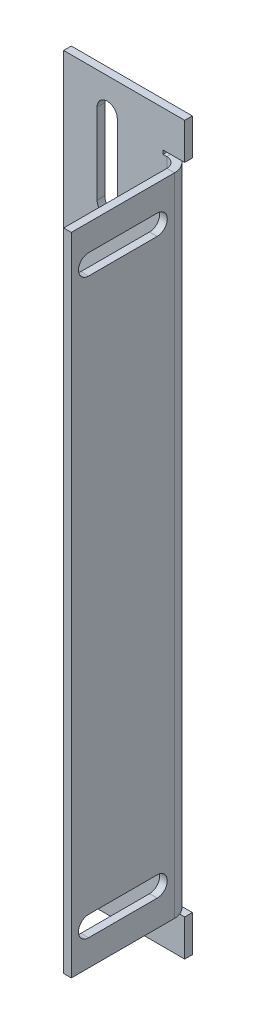
ISO-10303-21;
HEADER;
FILE_DESCRIPTION(('STEP AP214'),'2;1');
FILE_NAME('part.step','',(''),(''),'','','');
FILE_SCHEMA(('AUTOMOTIVE_DESIGN { 1 0 10303 214 1 1 1 1 }'));
ENDSEC;
DATA;
#1=APPLICATION_CONTEXT('core data for automotive mechanical design processes');
#2=APPLICATION_PROTOCOL_DEFINITION('international standard','automotive_design',2000,#1);
#3=PRODUCT_CONTEXT('',#1,'mechanical');
#4=PRODUCT('Part','Part','',(#3));
#5=PRODUCT_RELATED_PRODUCT_CATEGORY('part','',(#4));
#6=PRODUCT_DEFINITION_FORMATION('','',#4);
#7=PRODUCT_DEFINITION_CONTEXT('part definition',#1,'design');
#8=PRODUCT_DEFINITION('design','',#6,#7);
#9=PRODUCT_DEFINITION_SHAPE('','',#8);
#10=(LENGTH_UNIT() NAMED_UNIT(*) SI_UNIT(.MILLI.,.METRE.));
#11=(NAMED_UNIT(*) PLANE_ANGLE_UNIT() SI_UNIT($,.RADIAN.));
#12=(NAMED_UNIT(*) SI_UNIT($,.STERADIAN.) SOLID_ANGLE_UNIT());
#13=UNCERTAINTY_MEASURE_WITH_UNIT(LENGTH_MEASURE(1.E-05),#10,'distance_accuracy_value','');
#14=(GEOMETRIC_REPRESENTATION_CONTEXT(3) GLOBAL_UNCERTAINTY_ASSIGNED_CONTEXT((#13)) GLOBAL_UNIT_ASSIGNED_CONTEXT((#10,
#11,#12)) REPRESENTATION_CONTEXT('',''));
#15=CARTESIAN_POINT('',(0.,0.,0.));
#16=DIRECTION('',(0.,0.,1.));
#17=DIRECTION('',(1.,0.,0.));
#18=AXIS2_PLACEMENT_3D('',#15,#16,#17);
#19=CARTESIAN_POINT('',(0.,66.8554448024296,-1.89738));
#20=DIRECTION('',(1.,0.,0.));
#21=DIRECTION('',(0.,0.,-1.));
#22=AXIS2_PLACEMENT_3D('',#19,#20,#21);
#23=PLANE('',#22);
#24=DIRECTION('',(0.,1.,0.));
#25=VECTOR('',#24,1.);
#26=CARTESIAN_POINT('',(0.,66.8554448024296,0.));
#27=LINE('',#26,#25);
#28=CARTESIAN_POINT('',(0.,57.8041348024296,0.));
#29=VERTEX_POINT('',#28);
#30=CARTESIAN_POINT('',(0.,66.8554448024296,0.));
#31=VERTEX_POINT('',#30);
#32=EDGE_CURVE('E495',#29,#31,#27,.T.);
#33=ORIENTED_EDGE('',*,*,#32,.F.);
#34=DIRECTION('',(0.,0.,-1.));
#35=VECTOR('',#34,1.);
#36=CARTESIAN_POINT('',(0.,57.8041348024296,0.));
#37=LINE('',#36,#35);
#38=CARTESIAN_POINT('',(0.,57.8041348024296,-1.89738));
#39=VERTEX_POINT('',#38);
#40=EDGE_CURVE('E435',#29,#39,#37,.T.);
#41=ORIENTED_EDGE('',*,*,#40,.T.);
#42=DIRECTION('',(0.,1.,0.));
#43=VECTOR('',#42,1.);
#44=CARTESIAN_POINT('',(0.,66.8554448024296,-1.89738));
#45=LINE('',#44,#43);
#46=CARTESIAN_POINT('',(0.,66.8554448024296,-1.89738));
#47=VERTEX_POINT('',#46);
#48=EDGE_CURVE('E482',#39,#47,#45,.T.);
#49=ORIENTED_EDGE('',*,*,#48,.T.);
#50=DIRECTION('',(0.,0.,1.));
#51=VECTOR('',#50,1.);
#52=CARTESIAN_POINT('',(0.,66.8554448024296,-1.89738));
#53=LINE('',#52,#51);
#54=EDGE_CURVE('E504',#47,#31,#53,.T.);
#55=ORIENTED_EDGE('',*,*,#54,.T.);
#56=EDGE_LOOP('',(#33,#41,#49,#55));
#57=FACE_BOUND('',#56,.T.);
#58=ADVANCED_FACE('F56',(#57),#23,.T.);
#59=CARTESIAN_POINT('',(0.,-113.14455519757,-1.89738));
#60=VERTEX_POINT('',#59);
#61=CARTESIAN_POINT('',(0.,-104.09324519757,-1.89738));
#62=VERTEX_POINT('',#61);
#63=EDGE_CURVE('E483',#60,#62,#45,.T.);
#64=ORIENTED_EDGE('',*,*,#63,.T.);
#65=DIRECTION('',(0.,0.,-1.));
#66=VECTOR('',#65,1.);
#67=CARTESIAN_POINT('',(0.,-104.09324519757,0.));
#68=LINE('',#67,#66);
#69=CARTESIAN_POINT('',(0.,-104.09324519757,0.));
#70=VERTEX_POINT('',#69);
#71=EDGE_CURVE('E451',#70,#62,#68,.T.);
#72=ORIENTED_EDGE('',*,*,#71,.F.);
#73=CARTESIAN_POINT('',(0.,-113.14455519757,0.));
#74=VERTEX_POINT('',#73);
#75=EDGE_CURVE('E496',#74,#70,#27,.T.);
#76=ORIENTED_EDGE('',*,*,#75,.F.);
#77=DIRECTION('',(0.,0.,1.));
#78=VECTOR('',#77,1.);
#79=CARTESIAN_POINT('',(0.,-113.14455519757,-1.89738));
#80=LINE('',#79,#78);
#81=EDGE_CURVE('E507',#60,#74,#80,.T.);
#82=ORIENTED_EDGE('',*,*,#81,.F.);
#83=EDGE_LOOP('',(#64,#72,#76,#82));
#84=FACE_BOUND('',#83,.T.);
#85=ADVANCED_FACE('F543',(#84),#23,.T.);
#86=CARTESIAN_POINT('',(0.,0.,-1.89738));
#87=DIRECTION('',(0.,0.,1.));
#88=DIRECTION('',(1.,0.,0.));
#89=AXIS2_PLACEMENT_3D('',#86,#87,#88);
#90=PLANE('',#89);
#91=DIRECTION('',(0.,1.,0.));
#92=VECTOR('',#91,1.);
#93=CARTESIAN_POINT('',(-21.708962543054,38.8554448024297,-1.89738));
#94=LINE('',#93,#92);
#95=CARTESIAN_POINT('',(-21.708962543054,38.8554448024297,-1.89738));
#96=VERTEX_POINT('',#95);
#97=CARTESIAN_POINT('',(-21.708962543054,58.8554448024297,-1.89738));
#98=VERTEX_POINT('',#97);
#99=EDGE_CURVE('E276',#96,#98,#94,.T.);
#100=ORIENTED_EDGE('',*,*,#99,.F.);
#101=CARTESIAN_POINT('',(-19.208962543054,38.8554448024297,-1.89738));
#102=DIRECTION('',(0.,0.,-1.));
#103=DIRECTION('',(-1.,0.,0.));
#104=AXIS2_PLACEMENT_3D('',#101,#102,#103);
#105=CIRCLE('',#104,2.5);
#106=CARTESIAN_POINT('',(-16.708962543054,38.8554448024297,-1.89738));
#107=VERTEX_POINT('',#106);
#108=EDGE_CURVE('E71',#107,#96,#105,.T.);
#109=ORIENTED_EDGE('',*,*,#108,.F.);
#110=DIRECTION('',(0.,-1.,0.));
#111=VECTOR('',#110,1.);
#112=CARTESIAN_POINT('',(-16.708962543054,38.8554448024297,-1.89738));
#113=LINE('',#112,#111);
#114=CARTESIAN_POINT('',(-16.708962543054,58.8554448024297,-1.89738));
#115=VERTEX_POINT('',#114);
#116=EDGE_CURVE('E283',#115,#107,#113,.T.);
#117=ORIENTED_EDGE('',*,*,#116,.F.);
#118=CARTESIAN_POINT('',(-19.208962543054,58.8554448024297,-1.89738));
#119=DIRECTION('',(0.,0.,-1.));
#120=DIRECTION('',(-1.,0.,0.));
#121=AXIS2_PLACEMENT_3D('',#118,#119,#120);
#122=CIRCLE('',#121,2.5);
#123=EDGE_CURVE('E267',#98,#115,#122,.T.);
#124=ORIENTED_EDGE('',*,*,#123,.F.);
#125=EDGE_LOOP('',(#100,#109,#117,#124));
#126=FACE_BOUND('',#125,.T.);
#127=DIRECTION('',(0.,1.,0.));
#128=VECTOR('',#127,1.);
#129=CARTESIAN_POINT('',(-21.708962543054,-105.14455519757,-1.89738));
#130=LINE('',#129,#128);
#131=CARTESIAN_POINT('',(-21.708962543054,-105.14455519757,-1.89738));
#132=VERTEX_POINT('',#131);
#133=CARTESIAN_POINT('',(-21.708962543054,-85.1445551975703,-1.89738));
#134=VERTEX_POINT('',#133);
#135=EDGE_CURVE('E294',#132,#134,#130,.T.);
#136=ORIENTED_EDGE('',*,*,#135,.F.);
#137=CARTESIAN_POINT('',(-19.208962543054,-105.14455519757,-1.89738));
#138=DIRECTION('',(0.,0.,-1.));
#139=DIRECTION('',(-1.,0.,0.));
#140=AXIS2_PLACEMENT_3D('',#137,#138,#139);
#141=CIRCLE('',#140,2.5);
#142=CARTESIAN_POINT('',(-16.708962543054,-105.14455519757,-1.89738));
#143=VERTEX_POINT('',#142);
#144=EDGE_CURVE('E290',#143,#132,#141,.T.);
#145=ORIENTED_EDGE('',*,*,#144,.F.);
#146=DIRECTION('',(0.,-1.,0.));
#147=VECTOR('',#146,1.);
#148=CARTESIAN_POINT('',(-16.708962543054,-105.14455519757,-1.89738));
#149=LINE('',#148,#147);
#150=CARTESIAN_POINT('',(-16.708962543054,-85.1445551975703,-1.89738));
#151=VERTEX_POINT('',#150);
#152=EDGE_CURVE('E300',#151,#143,#149,.T.);
#153=ORIENTED_EDGE('',*,*,#152,.F.);
#154=CARTESIAN_POINT('',(-19.208962543054,-85.1445551975703,-1.89738));
#155=DIRECTION('',(0.,0.,-1.));
#156=DIRECTION('',(-1.,0.,0.));
#157=AXIS2_PLACEMENT_3D('',#154,#155,#156);
#158=CIRCLE('',#157,2.5);
#159=EDGE_CURVE('E297',#134,#151,#158,.T.);
#160=ORIENTED_EDGE('',*,*,#159,.F.);
#161=EDGE_LOOP('',(#136,#145,#153,#160));
#162=FACE_BOUND('',#161,.T.);
#163=DIRECTION('',(1.,0.,0.));
#164=VECTOR('',#163,1.);
#165=CARTESIAN_POINT('',(0.,57.8041348024296,-1.89738));
#166=LINE('',#165,#164);
#167=CARTESIAN_POINT('',(-5.38606999999999,57.8041348024296,-1.89738));
#168=VERTEX_POINT('',#167);
#169=EDGE_CURVE('E472',#168,#39,#166,.T.);
#170=ORIENTED_EDGE('',*,*,#169,.F.);
#171=DIRECTION('',(0.,1.,0.));
#172=VECTOR('',#171,1.);
#173=CARTESIAN_POINT('',(-5.38606999999999,0.,-1.89738));
#174=LINE('',#173,#172);
#175=CARTESIAN_POINT('',(-5.38606999999999,56.8554448024296,-1.89738));
#176=VERTEX_POINT('',#175);
#177=EDGE_CURVE('E470',#176,#168,#174,.T.);
#178=ORIENTED_EDGE('',*,*,#177,.F.);
#179=DIRECTION('',(-1.,0.,0.));
#180=VECTOR('',#179,1.);
#181=CARTESIAN_POINT('',(0.,56.8554448024296,-1.89738));
#182=LINE('',#181,#180);
#183=CARTESIAN_POINT('',(-4.43737999999999,56.8554448024296,-1.89737999999999));
#184=VERTEX_POINT('',#183);
#185=EDGE_CURVE('E468',#184,#176,#182,.T.);
#186=ORIENTED_EDGE('',*,*,#185,.F.);
#187=DIRECTION('',(0.,1.,0.));
#188=VECTOR('',#187,1.);
#189=CARTESIAN_POINT('',(-4.43737999999999,56.8554448024296,-1.89737999999999));
#190=LINE('',#189,#188);
#191=CARTESIAN_POINT('',(-4.43737999999999,-103.14455519757,-1.89738));
#192=VERTEX_POINT('',#191);
#193=EDGE_CURVE('E407',#184,#192,#190,.F.);
#194=ORIENTED_EDGE('',*,*,#193,.T.);
#195=DIRECTION('',(1.,0.,0.));
#196=VECTOR('',#195,1.);
#197=CARTESIAN_POINT('',(0.,-103.14455519757,-1.89738));
#198=LINE('',#197,#196);
#199=CARTESIAN_POINT('',(-5.38606999999999,-103.14455519757,-1.89738));
#200=VERTEX_POINT('',#199);
#201=EDGE_CURVE('E466',#200,#192,#198,.T.);
#202=ORIENTED_EDGE('',*,*,#201,.F.);
#203=DIRECTION('',(0.,1.,0.));
#204=VECTOR('',#203,1.);
#205=CARTESIAN_POINT('',(-5.38606999999999,0.,-1.89738));
#206=LINE('',#205,#204);
#207=CARTESIAN_POINT('',(-5.38606999999999,-104.09324519757,-1.89738));
#208=VERTEX_POINT('',#207);
#209=EDGE_CURVE('E464',#208,#200,#206,.T.);
#210=ORIENTED_EDGE('',*,*,#209,.F.);
#211=DIRECTION('',(-1.,0.,0.));
#212=VECTOR('',#211,1.);
#213=CARTESIAN_POINT('',(-5.36414851302966E-13,-104.09324519757,-1.89738));
#214=LINE('',#213,#212);
#215=EDGE_CURVE('E434',#62,#208,#214,.T.);
#216=ORIENTED_EDGE('',*,*,#215,.F.);
#217=ORIENTED_EDGE('',*,*,#63,.F.);
#218=DIRECTION('',(1.,0.,0.));
#219=VECTOR('',#218,1.);
#220=CARTESIAN_POINT('',(-30.,-113.14455519757,-1.89738));
#221=LINE('',#220,#219);
#222=CARTESIAN_POINT('',(-30.,-113.14455519757,-1.89738));
#223=VERTEX_POINT('',#222);
#224=EDGE_CURVE('E478',#223,#60,#221,.T.);
#225=ORIENTED_EDGE('',*,*,#224,.F.);
#226=DIRECTION('',(0.,-1.,0.));
#227=VECTOR('',#226,1.);
#228=CARTESIAN_POINT('',(-30.,66.8554448024296,-1.89738));
#229=LINE('',#228,#227);
#230=CARTESIAN_POINT('',(-30.,66.8554448024296,-1.89738));
#231=VERTEX_POINT('',#230);
#232=EDGE_CURVE('E475',#231,#223,#229,.T.);
#233=ORIENTED_EDGE('',*,*,#232,.F.);
#234=DIRECTION('',(-1.,0.,0.));
#235=VECTOR('',#234,1.);
#236=CARTESIAN_POINT('',(-30.,66.8554448024296,-1.89738));
#237=LINE('',#236,#235);
#238=EDGE_CURVE('E486',#47,#231,#237,.T.);
#239=ORIENTED_EDGE('',*,*,#238,.F.);
#240=ORIENTED_EDGE('',*,*,#48,.F.);
#241=EDGE_LOOP('',(#170,#178,#186,#194,#202,#210,#216,#217,#225,#233,#239,#240));
#242=FACE_BOUND('',#241,.T.);
#243=ADVANCED_FACE('F280',(#126,#162,#242),#90,.F.);
#244=CARTESIAN_POINT('',(0.,0.,0.));
#245=DIRECTION('',(0.,0.,1.));
#246=DIRECTION('',(1.,0.,0.));
#247=AXIS2_PLACEMENT_3D('',#244,#245,#246);
#248=PLANE('',#247);
#249=CARTESIAN_POINT('',(-19.208962543054,38.8554448024297,0.));
#250=DIRECTION('',(0.,0.,1.));
#251=DIRECTION('',(1.,0.,0.));
#252=AXIS2_PLACEMENT_3D('',#249,#250,#251);
#253=CIRCLE('',#252,2.5);
#254=CARTESIAN_POINT('',(-21.708962543054,38.8554448024297,0.));
#255=VERTEX_POINT('',#254);
#256=CARTESIAN_POINT('',(-16.708962543054,38.8554448024297,0.));
#257=VERTEX_POINT('',#256);
#258=EDGE_CURVE('E13',#255,#257,#253,.T.);
#259=ORIENTED_EDGE('',*,*,#258,.F.);
#260=DIRECTION('',(0.,-1.,0.));
#261=VECTOR('',#260,1.);
#262=CARTESIAN_POINT('',(-21.708962543054,0.,0.));
#263=LINE('',#262,#261);
#264=CARTESIAN_POINT('',(-21.708962543054,58.8554448024297,0.));
#265=VERTEX_POINT('',#264);
#266=EDGE_CURVE('E518',#265,#255,#263,.T.);
#267=ORIENTED_EDGE('',*,*,#266,.F.);
#268=CARTESIAN_POINT('',(-19.208962543054,58.8554448024297,0.));
#269=DIRECTION('',(0.,0.,1.));
#270=DIRECTION('',(1.,0.,0.));
#271=AXIS2_PLACEMENT_3D('',#268,#269,#270);
#272=CIRCLE('',#271,2.5);
#273=CARTESIAN_POINT('',(-16.708962543054,58.8554448024297,0.));
#274=VERTEX_POINT('',#273);
#275=EDGE_CURVE('E270',#274,#265,#272,.T.);
#276=ORIENTED_EDGE('',*,*,#275,.F.);
#277=DIRECTION('',(0.,1.,0.));
#278=VECTOR('',#277,1.);
#279=CARTESIAN_POINT('',(-16.708962543054,0.,0.));
#280=LINE('',#279,#278);
#281=EDGE_CURVE('E64',#257,#274,#280,.T.);
#282=ORIENTED_EDGE('',*,*,#281,.F.);
#283=EDGE_LOOP('',(#259,#267,#276,#282));
#284=FACE_BOUND('',#283,.T.);
#285=CARTESIAN_POINT('',(-19.208962543054,-105.14455519757,0.));
#286=DIRECTION('',(0.,0.,1.));
#287=DIRECTION('',(1.,0.,0.));
#288=AXIS2_PLACEMENT_3D('',#285,#286,#287);
#289=CIRCLE('',#288,2.5);
#290=CARTESIAN_POINT('',(-21.708962543054,-105.14455519757,0.));
#291=VERTEX_POINT('',#290);
#292=CARTESIAN_POINT('',(-16.708962543054,-105.14455519757,0.));
#293=VERTEX_POINT('',#292);
#294=EDGE_CURVE('E516',#291,#293,#289,.T.);
#295=ORIENTED_EDGE('',*,*,#294,.F.);
#296=DIRECTION('',(0.,-1.,0.));
#297=VECTOR('',#296,1.);
#298=CARTESIAN_POINT('',(-21.708962543054,0.,0.));
#299=LINE('',#298,#297);
#300=CARTESIAN_POINT('',(-21.708962543054,-85.1445551975703,0.));
#301=VERTEX_POINT('',#300);
#302=EDGE_CURVE('E503',#301,#291,#299,.T.);
#303=ORIENTED_EDGE('',*,*,#302,.F.);
#304=CARTESIAN_POINT('',(-19.208962543054,-85.1445551975703,0.));
#305=DIRECTION('',(0.,0.,1.));
#306=DIRECTION('',(1.,0.,0.));
#307=AXIS2_PLACEMENT_3D('',#304,#305,#306);
#308=CIRCLE('',#307,2.5);
#309=CARTESIAN_POINT('',(-16.708962543054,-85.1445551975703,0.));
#310=VERTEX_POINT('',#309);
#311=EDGE_CURVE('E511',#310,#301,#308,.T.);
#312=ORIENTED_EDGE('',*,*,#311,.F.);
#313=DIRECTION('',(0.,1.,0.));
#314=VECTOR('',#313,1.);
#315=CARTESIAN_POINT('',(-16.708962543054,0.,0.));
#316=LINE('',#315,#314);
#317=EDGE_CURVE('E514',#293,#310,#316,.T.);
#318=ORIENTED_EDGE('',*,*,#317,.F.);
#319=EDGE_LOOP('',(#295,#303,#312,#318));
#320=FACE_BOUND('',#319,.T.);
#321=DIRECTION('',(0.,-1.,0.));
#322=VECTOR('',#321,1.);
#323=CARTESIAN_POINT('',(-5.38606999999999,57.8041348024296,0.));
#324=LINE('',#323,#322);
#325=CARTESIAN_POINT('',(-5.38606999999999,57.8041348024296,0.));
#326=VERTEX_POINT('',#325);
#327=CARTESIAN_POINT('',(-5.38606999999999,56.8554448024296,0.));
#328=VERTEX_POINT('',#327);
#329=EDGE_CURVE('E436',#326,#328,#324,.T.);
#330=ORIENTED_EDGE('',*,*,#329,.F.);
#331=DIRECTION('',(-1.,0.,0.));
#332=VECTOR('',#331,1.);
#333=CARTESIAN_POINT('',(0.,57.8041348024296,0.));
#334=LINE('',#333,#332);
#335=EDGE_CURVE('E431',#29,#326,#334,.T.);
#336=ORIENTED_EDGE('',*,*,#335,.F.);
#337=ORIENTED_EDGE('',*,*,#32,.T.);
#338=DIRECTION('',(-1.,0.,0.));
#339=VECTOR('',#338,1.);
#340=CARTESIAN_POINT('',(-30.,66.8554448024296,0.));
#341=LINE('',#340,#339);
#342=CARTESIAN_POINT('',(-30.,66.8554448024296,0.));
#343=VERTEX_POINT('',#342);
#344=EDGE_CURVE('E479',#31,#343,#341,.T.);
#345=ORIENTED_EDGE('',*,*,#344,.T.);
#346=DIRECTION('',(0.,-1.,0.));
#347=VECTOR('',#346,1.);
#348=CARTESIAN_POINT('',(-30.,66.8554448024296,0.));
#349=LINE('',#348,#347);
#350=CARTESIAN_POINT('',(-30.,-113.14455519757,0.));
#351=VERTEX_POINT('',#350);
#352=EDGE_CURVE('E474',#343,#351,#349,.T.);
#353=ORIENTED_EDGE('',*,*,#352,.T.);
#354=DIRECTION('',(1.,0.,0.));
#355=VECTOR('',#354,1.);
#356=CARTESIAN_POINT('',(-30.,-113.14455519757,0.));
#357=LINE('',#356,#355);
#358=EDGE_CURVE('E492',#351,#74,#357,.T.);
#359=ORIENTED_EDGE('',*,*,#358,.T.);
#360=ORIENTED_EDGE('',*,*,#75,.T.);
#361=DIRECTION('',(1.,0.,0.));
#362=VECTOR('',#361,1.);
#363=CARTESIAN_POINT('',(-5.38606999999999,-104.09324519757,0.));
#364=LINE('',#363,#362);
#365=CARTESIAN_POINT('',(-5.38606999999999,-104.09324519757,0.));
#366=VERTEX_POINT('',#365);
#367=EDGE_CURVE('E449',#366,#70,#364,.T.);
#368=ORIENTED_EDGE('',*,*,#367,.F.);
#369=DIRECTION('',(0.,-1.,0.));
#370=VECTOR('',#369,1.);
#371=CARTESIAN_POINT('',(-5.38606999999999,-103.14455519757,0.));
#372=LINE('',#371,#370);
#373=CARTESIAN_POINT('',(-5.38606999999999,-103.14455519757,0.));
#374=VERTEX_POINT('',#373);
#375=EDGE_CURVE('E446',#374,#366,#372,.T.);
#376=ORIENTED_EDGE('',*,*,#375,.F.);
#377=DIRECTION('',(-1.,0.,0.));
#378=VECTOR('',#377,1.);
#379=CARTESIAN_POINT('',(-4.43737999999999,-103.14455519757,0.));
#380=LINE('',#379,#378);
#381=CARTESIAN_POINT('',(-4.43737999999999,-103.14455519757,0.));
#382=VERTEX_POINT('',#381);
#383=EDGE_CURVE('E443',#382,#374,#380,.T.);
#384=ORIENTED_EDGE('',*,*,#383,.F.);
#385=DIRECTION('',(0.,1.,0.));
#386=VECTOR('',#385,1.);
#387=CARTESIAN_POINT('',(-4.43737999999999,56.8554448024296,0.));
#388=LINE('',#387,#386);
#389=CARTESIAN_POINT('',(-4.43737999999999,56.8554448024296,0.));
#390=VERTEX_POINT('',#389);
#391=EDGE_CURVE('E420',#390,#382,#388,.F.);
#392=ORIENTED_EDGE('',*,*,#391,.F.);
#393=DIRECTION('',(1.,0.,0.));
#394=VECTOR('',#393,1.);
#395=CARTESIAN_POINT('',(-5.38606999999999,56.8554448024296,0.));
#396=LINE('',#395,#394);
#397=EDGE_CURVE('E440',#328,#390,#396,.T.);
#398=ORIENTED_EDGE('',*,*,#397,.F.);
#399=EDGE_LOOP('',(#330,#336,#337,#345,#353,#359,#360,#368,#376,#384,#392,#398));
#400=FACE_BOUND('',#399,.T.);
#401=ADVANCED_FACE('F526',(#284,#320,#400),#248,.T.);
#402=CARTESIAN_POINT('',(-30.,66.8554448024296,-1.89738));
#403=DIRECTION('',(-1.,0.,0.));
#404=DIRECTION('',(0.,-1.,0.));
#405=AXIS2_PLACEMENT_3D('',#402,#403,#404);
#406=PLANE('',#405);
#407=ORIENTED_EDGE('',*,*,#352,.F.);
#408=DIRECTION('',(0.,0.,1.));
#409=VECTOR('',#408,1.);
#410=CARTESIAN_POINT('',(-30.,66.8554448024296,-1.89738));
#411=LINE('',#410,#409);
#412=EDGE_CURVE('E501',#231,#343,#411,.T.);
#413=ORIENTED_EDGE('',*,*,#412,.F.);
#414=ORIENTED_EDGE('',*,*,#232,.T.);
#415=DIRECTION('',(0.,0.,1.));
#416=VECTOR('',#415,1.);
#417=CARTESIAN_POINT('',(-30.,-113.14455519757,-1.89738));
#418=LINE('',#417,#416);
#419=EDGE_CURVE('E489',#223,#351,#418,.T.);
#420=ORIENTED_EDGE('',*,*,#419,.T.);
#421=EDGE_LOOP('',(#407,#413,#414,#420));
#422=FACE_BOUND('',#421,.T.);
#423=ADVANCED_FACE('F58',(#422),#406,.T.);
#424=CARTESIAN_POINT('',(-30.,66.8554448024296,-1.89738));
#425=DIRECTION('',(0.,1.,0.));
#426=DIRECTION('',(0.,0.,1.));
#427=AXIS2_PLACEMENT_3D('',#424,#425,#426);
#428=PLANE('',#427);
#429=ORIENTED_EDGE('',*,*,#344,.F.);
#430=ORIENTED_EDGE('',*,*,#54,.F.);
#431=ORIENTED_EDGE('',*,*,#238,.T.);
#432=ORIENTED_EDGE('',*,*,#412,.T.);
#433=EDGE_LOOP('',(#429,#430,#431,#432));
#434=FACE_BOUND('',#433,.T.);
#435=ADVANCED_FACE('F552',(#434),#428,.T.);
#436=CARTESIAN_POINT('',(-30.,-113.14455519757,-1.89738));
#437=DIRECTION('',(0.,-1.,0.));
#438=DIRECTION('',(1.,0.,0.));
#439=AXIS2_PLACEMENT_3D('',#436,#437,#438);
#440=PLANE('',#439);
#441=ORIENTED_EDGE('',*,*,#358,.F.);
#442=ORIENTED_EDGE('',*,*,#419,.F.);
#443=ORIENTED_EDGE('',*,*,#224,.T.);
#444=ORIENTED_EDGE('',*,*,#81,.T.);
#445=EDGE_LOOP('',(#441,#442,#443,#444));
#446=FACE_BOUND('',#445,.T.);
#447=ADVANCED_FACE('F554',(#446),#440,.T.);
#448=CARTESIAN_POINT('',(0.,57.8041348024296,0.));
#449=DIRECTION('',(0.,-1.,0.));
#450=DIRECTION('',(0.,0.,-1.));
#451=AXIS2_PLACEMENT_3D('',#448,#449,#450);
#452=PLANE('',#451);
#453=DIRECTION('',(0.,0.,-1.));
#454=VECTOR('',#453,1.);
#455=CARTESIAN_POINT('',(-5.38606999999999,57.8041348024296,0.));
#456=LINE('',#455,#454);
#457=EDGE_CURVE('E439',#326,#168,#456,.T.);
#458=ORIENTED_EDGE('',*,*,#457,.T.);
#459=ORIENTED_EDGE('',*,*,#169,.T.);
#460=ORIENTED_EDGE('',*,*,#40,.F.);
#461=ORIENTED_EDGE('',*,*,#335,.T.);
#462=EDGE_LOOP('',(#458,#459,#460,#461));
#463=FACE_BOUND('',#462,.T.);
#464=ADVANCED_FACE('F556',(#463),#452,.T.);
#465=CARTESIAN_POINT('',(-5.38606999999999,57.8041348024296,0.));
#466=DIRECTION('',(1.,0.,0.));
#467=DIRECTION('',(0.,0.,-1.));
#468=AXIS2_PLACEMENT_3D('',#465,#466,#467);
#469=PLANE('',#468);
#470=DIRECTION('',(0.,0.,-1.));
#471=VECTOR('',#470,1.);
#472=CARTESIAN_POINT('',(-5.38606999999999,56.8554448024296,0.));
#473=LINE('',#472,#471);
#474=EDGE_CURVE('E442',#328,#176,#473,.T.);
#475=ORIENTED_EDGE('',*,*,#474,.T.);
#476=ORIENTED_EDGE('',*,*,#177,.T.);
#477=ORIENTED_EDGE('',*,*,#457,.F.);
#478=ORIENTED_EDGE('',*,*,#329,.T.);
#479=EDGE_LOOP('',(#475,#476,#477,#478));
#480=FACE_BOUND('',#479,.T.);
#481=ADVANCED_FACE('F562',(#480),#469,.T.);
#482=CARTESIAN_POINT('',(-5.38606999999999,56.8554448024296,0.));
#483=DIRECTION('',(0.,1.,0.));
#484=DIRECTION('',(0.,0.,1.));
#485=AXIS2_PLACEMENT_3D('',#482,#483,#484);
#486=PLANE('',#485);
#487=DIRECTION('',(0.,0.,-1.));
#488=VECTOR('',#487,1.);
#489=CARTESIAN_POINT('',(-4.43737999999999,56.8554448024296,0.));
#490=LINE('',#489,#488);
#491=EDGE_CURVE('E414',#390,#184,#490,.T.);
#492=ORIENTED_EDGE('',*,*,#491,.T.);
#493=ORIENTED_EDGE('',*,*,#185,.T.);
#494=ORIENTED_EDGE('',*,*,#474,.F.);
#495=ORIENTED_EDGE('',*,*,#397,.T.);
#496=EDGE_LOOP('',(#492,#493,#494,#495));
#497=FACE_BOUND('',#496,.T.);
#498=ADVANCED_FACE('F586',(#497),#486,.T.);
#499=CARTESIAN_POINT('',(-4.43737999999999,-103.14455519757,0.));
#500=DIRECTION('',(0.,-1.,0.));
#501=DIRECTION('',(0.,0.,-1.));
#502=AXIS2_PLACEMENT_3D('',#499,#500,#501);
#503=PLANE('',#502);
#504=DIRECTION('',(0.,0.,-1.));
#505=VECTOR('',#504,1.);
#506=CARTESIAN_POINT('',(-5.38606999999999,-103.14455519757,0.));
#507=LINE('',#506,#505);
#508=EDGE_CURVE('E448',#374,#200,#507,.T.);
#509=ORIENTED_EDGE('',*,*,#508,.T.);
#510=ORIENTED_EDGE('',*,*,#201,.T.);
#511=DIRECTION('',(0.,0.,-1.));
#512=VECTOR('',#511,1.);
#513=CARTESIAN_POINT('',(-4.43737999999999,-103.14455519757,0.));
#514=LINE('',#513,#512);
#515=EDGE_CURVE('E425',#382,#192,#514,.T.);
#516=ORIENTED_EDGE('',*,*,#515,.F.);
#517=ORIENTED_EDGE('',*,*,#383,.T.);
#518=EDGE_LOOP('',(#509,#510,#516,#517));
#519=FACE_BOUND('',#518,.T.);
#520=ADVANCED_FACE('F660',(#519),#503,.T.);
#521=CARTESIAN_POINT('',(-5.38606999999999,-103.14455519757,0.));
#522=DIRECTION('',(1.,0.,0.));
#523=DIRECTION('',(0.,0.,-1.));
#524=AXIS2_PLACEMENT_3D('',#521,#522,#523);
#525=PLANE('',#524);
#526=DIRECTION('',(0.,0.,-1.));
#527=VECTOR('',#526,1.);
#528=CARTESIAN_POINT('',(-5.38606999999999,-104.09324519757,0.));
#529=LINE('',#528,#527);
#530=EDGE_CURVE('E428',#366,#208,#529,.T.);
#531=ORIENTED_EDGE('',*,*,#530,.T.);
#532=ORIENTED_EDGE('',*,*,#209,.T.);
#533=ORIENTED_EDGE('',*,*,#508,.F.);
#534=ORIENTED_EDGE('',*,*,#375,.T.);
#535=EDGE_LOOP('',(#531,#532,#533,#534));
#536=FACE_BOUND('',#535,.T.);
#537=ADVANCED_FACE('F656',(#536),#525,.T.);
#538=CARTESIAN_POINT('',(-5.38606999999999,-104.09324519757,0.));
#539=DIRECTION('',(0.,1.,0.));
#540=DIRECTION('',(0.,0.,1.));
#541=AXIS2_PLACEMENT_3D('',#538,#539,#540);
#542=PLANE('',#541);
#543=ORIENTED_EDGE('',*,*,#71,.T.);
#544=ORIENTED_EDGE('',*,*,#215,.T.);
#545=ORIENTED_EDGE('',*,*,#530,.F.);
#546=ORIENTED_EDGE('',*,*,#367,.T.);
#547=EDGE_LOOP('',(#543,#544,#545,#546));
#548=FACE_BOUND('',#547,.T.);
#549=ADVANCED_FACE('F650',(#548),#542,.T.);
#550=CARTESIAN_POINT('',(-4.43737999999999,-103.14455519757,2.53999999999999));
#551=DIRECTION('',(0.,-1.,0.));
#552=DIRECTION('',(0.,0.,-1.));
#553=AXIS2_PLACEMENT_3D('',#550,#551,#552);
#554=PLANE('',#553);
#555=DIRECTION('',(-1.,0.,0.));
#556=VECTOR('',#555,1.);
#557=CARTESIAN_POINT('',(0.,-103.14455519757,2.53999999999998));
#558=LINE('',#557,#556);
#559=CARTESIAN_POINT('',(-1.89737999999999,-103.14455519757,2.53999999999998));
#560=VERTEX_POINT('',#559);
#561=CARTESIAN_POINT('',(0.,-103.14455519757,2.53999999999998));
#562=VERTEX_POINT('',#561);
#563=EDGE_CURVE('E376',#560,#562,#558,.F.);
#564=ORIENTED_EDGE('',*,*,#563,.F.);
#565=CARTESIAN_POINT('',(-4.43737999999999,-103.14455519757,2.53999999999999));
#566=DIRECTION('',(0.,1.,0.));
#567=DIRECTION('',(0.,0.,1.));
#568=AXIS2_PLACEMENT_3D('',#565,#566,#567);
#569=CIRCLE('',#568,2.54);
#570=EDGE_CURVE('E417',#382,#560,#569,.F.);
#571=ORIENTED_EDGE('',*,*,#570,.F.);
#572=ORIENTED_EDGE('',*,*,#515,.T.);
#573=CARTESIAN_POINT('',(-4.43737999999999,-103.14455519757,2.53999999999999));
#574=DIRECTION('',(0.,1.,0.));
#575=DIRECTION('',(0.,0.,1.));
#576=AXIS2_PLACEMENT_3D('',#573,#574,#575);
#577=CIRCLE('',#576,4.43738);
#578=EDGE_CURVE('E410',#192,#562,#577,.F.);
#579=ORIENTED_EDGE('',*,*,#578,.T.);
#580=EDGE_LOOP('',(#564,#571,#572,#579));
#581=FACE_BOUND('',#580,.T.);
#582=ADVANCED_FACE('F596',(#581),#554,.T.);
#583=CARTESIAN_POINT('',(-4.43737999999999,56.8554448024296,2.54));
#584=DIRECTION('',(0.,-1.,0.));
#585=DIRECTION('',(0.,0.,-1.));
#586=AXIS2_PLACEMENT_3D('',#583,#584,#585);
#587=PLANE('',#586);
#588=CARTESIAN_POINT('',(-4.43737999999999,56.8554448024296,2.54));
#589=DIRECTION('',(0.,1.,0.));
#590=DIRECTION('',(0.,0.,1.));
#591=AXIS2_PLACEMENT_3D('',#588,#589,#590);
#592=CIRCLE('',#591,2.54);
#593=CARTESIAN_POINT('',(-1.89737999999999,56.8554448024296,2.54));
#594=VERTEX_POINT('',#593);
#595=EDGE_CURVE('E380',#594,#390,#592,.T.);
#596=ORIENTED_EDGE('',*,*,#595,.F.);
#597=DIRECTION('',(-1.,0.,0.));
#598=VECTOR('',#597,1.);
#599=CARTESIAN_POINT('',(-1.89737999999998,56.8554448024296,2.53999999999999));
#600=LINE('',#599,#598);
#601=CARTESIAN_POINT('',(0.,56.8554448024296,2.53999999999999));
#602=VERTEX_POINT('',#601);
#603=EDGE_CURVE('E400',#594,#602,#600,.F.);
#604=ORIENTED_EDGE('',*,*,#603,.T.);
#605=CARTESIAN_POINT('',(-4.43737999999999,56.8554448024296,2.54));
#606=DIRECTION('',(0.,1.,0.));
#607=DIRECTION('',(0.,0.,1.));
#608=AXIS2_PLACEMENT_3D('',#605,#606,#607);
#609=CIRCLE('',#608,4.43738);
#610=EDGE_CURVE('E411',#602,#184,#609,.T.);
#611=ORIENTED_EDGE('',*,*,#610,.T.);
#612=ORIENTED_EDGE('',*,*,#491,.F.);
#613=EDGE_LOOP('',(#596,#604,#611,#612));
#614=FACE_BOUND('',#613,.T.);
#615=ADVANCED_FACE('F645',(#614),#587,.F.);
#616=CARTESIAN_POINT('',(-4.43737999999999,56.8554448024296,2.54));
#617=DIRECTION('',(0.,1.,0.));
#618=DIRECTION('',(1.,0.,0.));
#619=AXIS2_PLACEMENT_3D('',#616,#617,#618);
#620=CYLINDRICAL_SURFACE('',#619,4.43738);
#621=ORIENTED_EDGE('',*,*,#193,.F.);
#622=ORIENTED_EDGE('',*,*,#610,.F.);
#623=DIRECTION('',(0.,1.,0.));
#624=VECTOR('',#623,1.);
#625=CARTESIAN_POINT('',(0.,-103.14455519757,2.53999999999998));
#626=LINE('',#625,#624);
#627=EDGE_CURVE('E398',#602,#562,#626,.F.);
#628=ORIENTED_EDGE('',*,*,#627,.T.);
#629=ORIENTED_EDGE('',*,*,#578,.F.);
#630=EDGE_LOOP('',(#621,#622,#628,#629));
#631=FACE_BOUND('',#630,.T.);
#632=ADVANCED_FACE('F599',(#631),#620,.T.);
#633=CARTESIAN_POINT('',(-4.43737999999999,56.8554448024296,2.54));
#634=DIRECTION('',(0.,1.,0.));
#635=DIRECTION('',(1.,0.,0.));
#636=AXIS2_PLACEMENT_3D('',#633,#634,#635);
#637=CYLINDRICAL_SURFACE('',#636,2.54);
#638=ORIENTED_EDGE('',*,*,#391,.T.);
#639=ORIENTED_EDGE('',*,*,#570,.T.);
#640=DIRECTION('',(0.,1.,0.));
#641=VECTOR('',#640,1.);
#642=CARTESIAN_POINT('',(-1.89737999999999,-103.14455519757,2.53999999999998));
#643=LINE('',#642,#641);
#644=EDGE_CURVE('E403',#560,#594,#643,.T.);
#645=ORIENTED_EDGE('',*,*,#644,.T.);
#646=ORIENTED_EDGE('',*,*,#595,.T.);
#647=EDGE_LOOP('',(#638,#639,#645,#646));
#648=FACE_BOUND('',#647,.T.);
#649=ADVANCED_FACE('F620',(#648),#637,.F.);
#650=CARTESIAN_POINT('',(0.,-103.14455519757,0.));
#651=DIRECTION('',(0.,1.,0.));
#652=DIRECTION('',(0.,0.,1.));
#653=AXIS2_PLACEMENT_3D('',#650,#651,#652);
#654=PLANE('',#653);
#655=ORIENTED_EDGE('',*,*,#563,.T.);
#656=DIRECTION('',(0.,0.,-1.));
#657=VECTOR('',#656,1.);
#658=CARTESIAN_POINT('',(0.,-103.14455519757,0.));
#659=LINE('',#658,#657);
#660=CARTESIAN_POINT('',(0.,-103.14455519757,28.10262));
#661=VERTEX_POINT('',#660);
#662=EDGE_CURVE('E388',#661,#562,#659,.T.);
#663=ORIENTED_EDGE('',*,*,#662,.F.);
#664=DIRECTION('',(-1.,0.,0.));
#665=VECTOR('',#664,1.);
#666=CARTESIAN_POINT('',(0.,-103.14455519757,28.10262));
#667=LINE('',#666,#665);
#668=CARTESIAN_POINT('',(-1.8973799999999,-103.14455519757,28.10262));
#669=VERTEX_POINT('',#668);
#670=EDGE_CURVE('E381',#661,#669,#667,.T.);
#671=ORIENTED_EDGE('',*,*,#670,.T.);
#672=DIRECTION('',(0.,0.,1.));
#673=VECTOR('',#672,1.);
#674=CARTESIAN_POINT('',(-1.89738,-103.14455519757,0.));
#675=LINE('',#674,#673);
#676=EDGE_CURVE('E395',#669,#560,#675,.F.);
#677=ORIENTED_EDGE('',*,*,#676,.T.);
#678=EDGE_LOOP('',(#655,#663,#671,#677));
#679=FACE_BOUND('',#678,.T.);
#680=ADVANCED_FACE('F617',(#679),#654,.F.);
#681=CARTESIAN_POINT('',(0.,56.8554448024296,28.10262));
#682=DIRECTION('',(0.,-1.,0.));
#683=DIRECTION('',(0.,0.,-1.));
#684=AXIS2_PLACEMENT_3D('',#681,#682,#683);
#685=PLANE('',#684);
#686=ORIENTED_EDGE('',*,*,#603,.F.);
#687=DIRECTION('',(0.,0.,-1.));
#688=VECTOR('',#687,1.);
#689=CARTESIAN_POINT('',(-1.8973799999999,56.8554448024296,28.10262));
#690=LINE('',#689,#688);
#691=CARTESIAN_POINT('',(-1.8973799999999,56.8554448024296,28.10262));
#692=VERTEX_POINT('',#691);
#693=EDGE_CURVE('E393',#594,#692,#690,.F.);
#694=ORIENTED_EDGE('',*,*,#693,.T.);
#695=DIRECTION('',(-1.,0.,0.));
#696=VECTOR('',#695,1.);
#697=CARTESIAN_POINT('',(0.,56.8554448024296,28.10262));
#698=LINE('',#697,#696);
#699=CARTESIAN_POINT('',(0.,56.8554448024296,28.10262));
#700=VERTEX_POINT('',#699);
#701=EDGE_CURVE('E377',#700,#692,#698,.T.);
#702=ORIENTED_EDGE('',*,*,#701,.F.);
#703=DIRECTION('',(0.,0.,1.));
#704=VECTOR('',#703,1.);
#705=CARTESIAN_POINT('',(0.,56.8554448024296,0.));
#706=LINE('',#705,#704);
#707=EDGE_CURVE('E386',#602,#700,#706,.T.);
#708=ORIENTED_EDGE('',*,*,#707,.F.);
#709=EDGE_LOOP('',(#686,#694,#702,#708));
#710=FACE_BOUND('',#709,.T.);
#711=ADVANCED_FACE('F608',(#710),#685,.F.);
#712=CARTESIAN_POINT('',(0.,0.,0.));
#713=DIRECTION('',(-1.,0.,0.));
#714=DIRECTION('',(0.,0.,1.));
#715=AXIS2_PLACEMENT_3D('',#712,#713,#714);
#716=PLANE('',#715);
#717=DIRECTION('',(0.,0.,-1.));
#718=VECTOR('',#717,1.);
#719=CARTESIAN_POINT('',(0.,-91.6445551975703,0.));
#720=LINE('',#719,#718);
#721=CARTESIAN_POINT('',(0.,-91.6445551975703,23.82131));
#722=VERTEX_POINT('',#721);
#723=CARTESIAN_POINT('',(0.,-91.6445551975703,6.82130999999999));
#724=VERTEX_POINT('',#723);
#725=EDGE_CURVE('E338',#722,#724,#720,.T.);
#726=ORIENTED_EDGE('',*,*,#725,.T.);
#727=CARTESIAN_POINT('',(0.,-94.1445551975703,6.82130999999999));
#728=DIRECTION('',(-1.,0.,0.));
#729=DIRECTION('',(0.,0.,1.));
#730=AXIS2_PLACEMENT_3D('',#727,#728,#729);
#731=CIRCLE('',#730,2.5);
#732=CARTESIAN_POINT('',(0.,-96.6445551975703,6.82130999999999));
#733=VERTEX_POINT('',#732);
#734=EDGE_CURVE('E341',#724,#733,#731,.T.);
#735=ORIENTED_EDGE('',*,*,#734,.T.);
#736=DIRECTION('',(0.,0.,1.));
#737=VECTOR('',#736,1.);
#738=CARTESIAN_POINT('',(0.,-96.6445551975703,0.));
#739=LINE('',#738,#737);
#740=CARTESIAN_POINT('',(0.,-96.6445551975703,23.82131));
#741=VERTEX_POINT('',#740);
#742=EDGE_CURVE('E326',#733,#741,#739,.T.);
#743=ORIENTED_EDGE('',*,*,#742,.T.);
#744=CARTESIAN_POINT('',(0.,-94.1445551975703,23.82131));
#745=DIRECTION('',(-1.,0.,0.));
#746=DIRECTION('',(0.,0.,1.));
#747=AXIS2_PLACEMENT_3D('',#744,#745,#746);
#748=CIRCLE('',#747,2.5);
#749=EDGE_CURVE('E335',#741,#722,#748,.T.);
#750=ORIENTED_EDGE('',*,*,#749,.T.);
#751=EDGE_LOOP('',(#726,#735,#743,#750));
#752=FACE_BOUND('',#751,.T.);
#753=DIRECTION('',(0.,0.,1.));
#754=VECTOR('',#753,1.);
#755=CARTESIAN_POINT('',(0.,45.3554448024297,0.));
#756=LINE('',#755,#754);
#757=CARTESIAN_POINT('',(0.,45.3554448024297,6.82130999999999));
#758=VERTEX_POINT('',#757);
#759=CARTESIAN_POINT('',(0.,45.3554448024297,23.82131));
#760=VERTEX_POINT('',#759);
#761=EDGE_CURVE('E370',#758,#760,#756,.T.);
#762=ORIENTED_EDGE('',*,*,#761,.T.);
#763=CARTESIAN_POINT('',(0.,47.8554448024297,23.82131));
#764=DIRECTION('',(-1.,0.,0.));
#765=DIRECTION('',(0.,0.,1.));
#766=AXIS2_PLACEMENT_3D('',#763,#764,#765);
#767=CIRCLE('',#766,2.5);
#768=CARTESIAN_POINT('',(0.,50.3554448024297,23.82131));
#769=VERTEX_POINT('',#768);
#770=EDGE_CURVE('E373',#760,#769,#767,.T.);
#771=ORIENTED_EDGE('',*,*,#770,.T.);
#772=DIRECTION('',(0.,0.,-1.));
#773=VECTOR('',#772,1.);
#774=CARTESIAN_POINT('',(0.,50.3554448024297,0.));
#775=LINE('',#774,#773);
#776=CARTESIAN_POINT('',(0.,50.3554448024297,6.82130999999996));
#777=VERTEX_POINT('',#776);
#778=EDGE_CURVE('E358',#769,#777,#775,.T.);
#779=ORIENTED_EDGE('',*,*,#778,.T.);
#780=CARTESIAN_POINT('',(0.,47.8554448024297,6.82130999999999));
#781=DIRECTION('',(-1.,0.,0.));
#782=DIRECTION('',(0.,0.,1.));
#783=AXIS2_PLACEMENT_3D('',#780,#781,#782);
#784=CIRCLE('',#783,2.5);
#785=EDGE_CURVE('E367',#777,#758,#784,.T.);
#786=ORIENTED_EDGE('',*,*,#785,.T.);
#787=EDGE_LOOP('',(#762,#771,#779,#786));
#788=FACE_BOUND('',#787,.T.);
#789=ORIENTED_EDGE('',*,*,#627,.F.);
#790=ORIENTED_EDGE('',*,*,#707,.T.);
#791=DIRECTION('',(0.,-1.,0.));
#792=VECTOR('',#791,1.);
#793=CARTESIAN_POINT('',(0.,0.,28.10262));
#794=LINE('',#793,#792);
#795=EDGE_CURVE('E384',#700,#661,#794,.T.);
#796=ORIENTED_EDGE('',*,*,#795,.T.);
#797=ORIENTED_EDGE('',*,*,#662,.T.);
#798=EDGE_LOOP('',(#789,#790,#796,#797));
#799=FACE_BOUND('',#798,.T.);
#800=ADVANCED_FACE('F603',(#752,#788,#799),#716,.F.);
#801=CARTESIAN_POINT('',(-1.89738,0.,0.));
#802=DIRECTION('',(-1.,0.,0.));
#803=DIRECTION('',(0.,0.,1.));
#804=AXIS2_PLACEMENT_3D('',#801,#802,#803);
#805=PLANE('',#804);
#806=CARTESIAN_POINT('',(-1.89737999999998,-94.1445551975703,6.82131));
#807=DIRECTION('',(-1.,0.,0.));
#808=DIRECTION('',(0.,0.,1.));
#809=AXIS2_PLACEMENT_3D('',#806,#807,#808);
#810=CIRCLE('',#809,2.5);
#811=CARTESIAN_POINT('',(-1.89737999999998,-91.6445551975703,6.82131));
#812=VERTEX_POINT('',#811);
#813=CARTESIAN_POINT('',(-1.89737999999998,-96.6445551975703,6.82130999999997));
#814=VERTEX_POINT('',#813);
#815=EDGE_CURVE('E306',#812,#814,#810,.T.);
#816=ORIENTED_EDGE('',*,*,#815,.F.);
#817=DIRECTION('',(0.,0.,-1.));
#818=VECTOR('',#817,1.);
#819=CARTESIAN_POINT('',(-1.89737999999998,-91.6445551975703,6.82131));
#820=LINE('',#819,#818);
#821=CARTESIAN_POINT('',(-1.89737999999992,-91.6445551975703,23.82131));
#822=VERTEX_POINT('',#821);
#823=EDGE_CURVE('E320',#822,#812,#820,.T.);
#824=ORIENTED_EDGE('',*,*,#823,.F.);
#825=CARTESIAN_POINT('',(-1.89737999999992,-94.1445551975703,23.82131));
#826=DIRECTION('',(-1.,0.,0.));
#827=DIRECTION('',(0.,0.,1.));
#828=AXIS2_PLACEMENT_3D('',#825,#826,#827);
#829=CIRCLE('',#828,2.5);
#830=CARTESIAN_POINT('',(-1.89737999999992,-96.6445551975703,23.82131));
#831=VERTEX_POINT('',#830);
#832=EDGE_CURVE('E317',#831,#822,#829,.T.);
#833=ORIENTED_EDGE('',*,*,#832,.F.);
#834=DIRECTION('',(0.,0.,1.));
#835=VECTOR('',#834,1.);
#836=CARTESIAN_POINT('',(-1.89737999999998,-96.6445551975703,6.82131));
#837=LINE('',#836,#835);
#838=EDGE_CURVE('E314',#814,#831,#837,.T.);
#839=ORIENTED_EDGE('',*,*,#838,.F.);
#840=EDGE_LOOP('',(#816,#824,#833,#839));
#841=FACE_BOUND('',#840,.T.);
#842=CARTESIAN_POINT('',(-1.89737999999992,47.8554448024297,23.82131));
#843=DIRECTION('',(-1.,0.,0.));
#844=DIRECTION('',(0.,0.,1.));
#845=AXIS2_PLACEMENT_3D('',#842,#843,#844);
#846=CIRCLE('',#845,2.5);
#847=CARTESIAN_POINT('',(-1.89737999999992,45.3554448024297,23.82131));
#848=VERTEX_POINT('',#847);
#849=CARTESIAN_POINT('',(-1.89737999999992,50.3554448024297,23.82131));
#850=VERTEX_POINT('',#849);
#851=EDGE_CURVE('E344',#848,#850,#846,.T.);
#852=ORIENTED_EDGE('',*,*,#851,.F.);
#853=DIRECTION('',(0.,0.,1.));
#854=VECTOR('',#853,1.);
#855=CARTESIAN_POINT('',(-1.89737999999992,45.3554448024297,23.82131));
#856=LINE('',#855,#854);
#857=CARTESIAN_POINT('',(-1.89737999999998,45.3554448024297,6.82131));
#858=VERTEX_POINT('',#857);
#859=EDGE_CURVE('E352',#858,#848,#856,.T.);
#860=ORIENTED_EDGE('',*,*,#859,.F.);
#861=CARTESIAN_POINT('',(-1.89737999999998,47.8554448024297,6.82131));
#862=DIRECTION('',(-1.,0.,0.));
#863=DIRECTION('',(0.,0.,1.));
#864=AXIS2_PLACEMENT_3D('',#861,#862,#863);
#865=CIRCLE('',#864,2.5);
#866=CARTESIAN_POINT('',(-1.89737999999998,50.3554448024297,6.82131));
#867=VERTEX_POINT('',#866);
#868=EDGE_CURVE('E349',#867,#858,#865,.T.);
#869=ORIENTED_EDGE('',*,*,#868,.F.);
#870=DIRECTION('',(0.,0.,-1.));
#871=VECTOR('',#870,1.);
#872=CARTESIAN_POINT('',(-1.89737999999992,50.3554448024297,23.82131));
#873=LINE('',#872,#871);
#874=EDGE_CURVE('E346',#850,#867,#873,.T.);
#875=ORIENTED_EDGE('',*,*,#874,.F.);
#876=EDGE_LOOP('',(#852,#860,#869,#875));
#877=FACE_BOUND('',#876,.T.);
#878=ORIENTED_EDGE('',*,*,#693,.F.);
#879=ORIENTED_EDGE('',*,*,#644,.F.);
#880=ORIENTED_EDGE('',*,*,#676,.F.);
#881=DIRECTION('',(0.,1.,0.));
#882=VECTOR('',#881,1.);
#883=CARTESIAN_POINT('',(-1.8973799999999,-103.14455519757,28.10262));
#884=LINE('',#883,#882);
#885=EDGE_CURVE('E391',#692,#669,#884,.F.);
#886=ORIENTED_EDGE('',*,*,#885,.F.);
#887=EDGE_LOOP('',(#878,#879,#880,#886));
#888=FACE_BOUND('',#887,.T.);
#889=ADVANCED_FACE('F623',(#841,#877,#888),#805,.T.);
#890=CARTESIAN_POINT('',(0.,-103.14455519757,28.10262));
#891=DIRECTION('',(0.,0.,-1.));
#892=DIRECTION('',(-1.,0.,0.));
#893=AXIS2_PLACEMENT_3D('',#890,#891,#892);
#894=PLANE('',#893);
#895=ORIENTED_EDGE('',*,*,#885,.T.);
#896=ORIENTED_EDGE('',*,*,#670,.F.);
#897=ORIENTED_EDGE('',*,*,#795,.F.);
#898=ORIENTED_EDGE('',*,*,#701,.T.);
#899=EDGE_LOOP('',(#895,#896,#897,#898));
#900=FACE_BOUND('',#899,.T.);
#901=ADVANCED_FACE('F614',(#900),#894,.F.);
#902=CARTESIAN_POINT('',(8.10262000000008,47.8554448024297,23.82131));
#903=DIRECTION('',(-1.,0.,0.));
#904=DIRECTION('',(0.,0.,1.));
#905=AXIS2_PLACEMENT_3D('',#902,#903,#904);
#906=CYLINDRICAL_SURFACE('',#905,2.5);
#907=DIRECTION('',(-1.,0.,0.));
#908=VECTOR('',#907,1.);
#909=CARTESIAN_POINT('',(8.10262000000008,45.3554448024297,23.82131));
#910=LINE('',#909,#908);
#911=EDGE_CURVE('E356',#760,#848,#910,.T.);
#912=ORIENTED_EDGE('',*,*,#911,.T.);
#913=ORIENTED_EDGE('',*,*,#851,.T.);
#914=DIRECTION('',(-1.,0.,0.));
#915=VECTOR('',#914,1.);
#916=CARTESIAN_POINT('',(8.10262000000008,50.3554448024297,23.82131));
#917=LINE('',#916,#915);
#918=EDGE_CURVE('E355',#769,#850,#917,.T.);
#919=ORIENTED_EDGE('',*,*,#918,.F.);
#920=ORIENTED_EDGE('',*,*,#770,.F.);
#921=EDGE_LOOP('',(#912,#913,#919,#920));
#922=FACE_BOUND('',#921,.T.);
#923=ADVANCED_FACE('F631',(#922),#906,.F.);
#924=CARTESIAN_POINT('',(8.10262000000008,45.3554448024297,23.82131));
#925=DIRECTION('',(0.,-1.,0.));
#926=DIRECTION('',(0.,0.,-1.));
#927=AXIS2_PLACEMENT_3D('',#924,#925,#926);
#928=PLANE('',#927);
#929=DIRECTION('',(-1.,0.,0.));
#930=VECTOR('',#929,1.);
#931=CARTESIAN_POINT('',(8.10262000000002,45.3554448024297,6.82130999999997));
#932=LINE('',#931,#930);
#933=EDGE_CURVE('E359',#758,#858,#932,.T.);
#934=ORIENTED_EDGE('',*,*,#933,.T.);
#935=ORIENTED_EDGE('',*,*,#859,.T.);
#936=ORIENTED_EDGE('',*,*,#911,.F.);
#937=ORIENTED_EDGE('',*,*,#761,.F.);
#938=EDGE_LOOP('',(#934,#935,#936,#937));
#939=FACE_BOUND('',#938,.T.);
#940=ADVANCED_FACE('F809',(#939),#928,.F.);
#941=CARTESIAN_POINT('',(8.10262000000002,47.8554448024297,6.82130999999997));
#942=DIRECTION('',(-1.,0.,0.));
#943=DIRECTION('',(0.,0.,1.));
#944=AXIS2_PLACEMENT_3D('',#941,#942,#943);
#945=CYLINDRICAL_SURFACE('',#944,2.5);
#946=DIRECTION('',(-1.,0.,0.));
#947=VECTOR('',#946,1.);
#948=CARTESIAN_POINT('',(8.10262000000002,50.3554448024297,6.82130999999996));
#949=LINE('',#948,#947);
#950=EDGE_CURVE('E361',#777,#867,#949,.T.);
#951=ORIENTED_EDGE('',*,*,#950,.T.);
#952=ORIENTED_EDGE('',*,*,#868,.T.);
#953=ORIENTED_EDGE('',*,*,#933,.F.);
#954=ORIENTED_EDGE('',*,*,#785,.F.);
#955=EDGE_LOOP('',(#951,#952,#953,#954));
#956=FACE_BOUND('',#955,.T.);
#957=ADVANCED_FACE('F819',(#956),#945,.F.);
#958=CARTESIAN_POINT('',(8.10262000000008,50.3554448024297,23.82131));
#959=DIRECTION('',(0.,1.,0.));
#960=DIRECTION('',(0.,0.,1.));
#961=AXIS2_PLACEMENT_3D('',#958,#959,#960);
#962=PLANE('',#961);
#963=ORIENTED_EDGE('',*,*,#918,.T.);
#964=ORIENTED_EDGE('',*,*,#874,.T.);
#965=ORIENTED_EDGE('',*,*,#950,.F.);
#966=ORIENTED_EDGE('',*,*,#778,.F.);
#967=EDGE_LOOP('',(#963,#964,#965,#966));
#968=FACE_BOUND('',#967,.T.);
#969=ADVANCED_FACE('F830',(#968),#962,.F.);
#970=CARTESIAN_POINT('',(8.10262000000002,-94.1445551975703,6.82130999999997));
#971=DIRECTION('',(-1.,0.,0.));
#972=DIRECTION('',(0.,0.,1.));
#973=AXIS2_PLACEMENT_3D('',#970,#971,#972);
#974=CYLINDRICAL_SURFACE('',#973,2.5);
#975=DIRECTION('',(-1.,0.,0.));
#976=VECTOR('',#975,1.);
#977=CARTESIAN_POINT('',(8.10262000000002,-91.6445551975703,6.82130999999997));
#978=LINE('',#977,#976);
#979=EDGE_CURVE('E324',#724,#812,#978,.T.);
#980=ORIENTED_EDGE('',*,*,#979,.T.);
#981=ORIENTED_EDGE('',*,*,#815,.T.);
#982=DIRECTION('',(-1.,0.,0.));
#983=VECTOR('',#982,1.);
#984=CARTESIAN_POINT('',(8.10262000000002,-96.6445551975703,6.82130999999997));
#985=LINE('',#984,#983);
#986=EDGE_CURVE('E323',#733,#814,#985,.T.);
#987=ORIENTED_EDGE('',*,*,#986,.F.);
#988=ORIENTED_EDGE('',*,*,#734,.F.);
#989=EDGE_LOOP('',(#980,#981,#987,#988));
#990=FACE_BOUND('',#989,.T.);
#991=ADVANCED_FACE('F841',(#990),#974,.F.);
#992=CARTESIAN_POINT('',(8.10262000000002,-91.6445551975703,6.82130999999997));
#993=DIRECTION('',(0.,1.,0.));
#994=DIRECTION('',(0.,0.,1.));
#995=AXIS2_PLACEMENT_3D('',#992,#993,#994);
#996=PLANE('',#995);
#997=DIRECTION('',(-1.,0.,0.));
#998=VECTOR('',#997,1.);
#999=CARTESIAN_POINT('',(8.10262000000008,-91.6445551975703,23.82131));
#1000=LINE('',#999,#998);
#1001=EDGE_CURVE('E327',#722,#822,#1000,.T.);
#1002=ORIENTED_EDGE('',*,*,#1001,.T.);
#1003=ORIENTED_EDGE('',*,*,#823,.T.);
#1004=ORIENTED_EDGE('',*,*,#979,.F.);
#1005=ORIENTED_EDGE('',*,*,#725,.F.);
#1006=EDGE_LOOP('',(#1002,#1003,#1004,#1005));
#1007=FACE_BOUND('',#1006,.T.);
#1008=ADVANCED_FACE('F852',(#1007),#996,.F.);
#1009=CARTESIAN_POINT('',(8.10262000000008,-94.1445551975703,23.82131));
#1010=DIRECTION('',(-1.,0.,0.));
#1011=DIRECTION('',(0.,0.,1.));
#1012=AXIS2_PLACEMENT_3D('',#1009,#1010,#1011);
#1013=CYLINDRICAL_SURFACE('',#1012,2.5);
#1014=DIRECTION('',(-1.,0.,0.));
#1015=VECTOR('',#1014,1.);
#1016=CARTESIAN_POINT('',(8.10262000000008,-96.6445551975703,23.82131));
#1017=LINE('',#1016,#1015);
#1018=EDGE_CURVE('E329',#741,#831,#1017,.T.);
#1019=ORIENTED_EDGE('',*,*,#1018,.T.);
#1020=ORIENTED_EDGE('',*,*,#832,.T.);
#1021=ORIENTED_EDGE('',*,*,#1001,.F.);
#1022=ORIENTED_EDGE('',*,*,#749,.F.);
#1023=EDGE_LOOP('',(#1019,#1020,#1021,#1022));
#1024=FACE_BOUND('',#1023,.T.);
#1025=ADVANCED_FACE('F863',(#1024),#1013,.F.);
#1026=CARTESIAN_POINT('',(8.10262000000002,-96.6445551975703,6.82130999999997));
#1027=DIRECTION('',(0.,-1.,0.));
#1028=DIRECTION('',(0.,0.,-1.));
#1029=AXIS2_PLACEMENT_3D('',#1026,#1027,#1028);
#1030=PLANE('',#1029);
#1031=ORIENTED_EDGE('',*,*,#986,.T.);
#1032=ORIENTED_EDGE('',*,*,#838,.T.);
#1033=ORIENTED_EDGE('',*,*,#1018,.F.);
#1034=ORIENTED_EDGE('',*,*,#742,.F.);
#1035=EDGE_LOOP('',(#1031,#1032,#1033,#1034));
#1036=FACE_BOUND('',#1035,.T.);
#1037=ADVANCED_FACE('F874',(#1036),#1030,.F.);
#1038=CARTESIAN_POINT('',(-19.208962543054,-105.14455519757,8.10262));
#1039=DIRECTION('',(0.,0.,-1.));
#1040=DIRECTION('',(-1.,0.,0.));
#1041=AXIS2_PLACEMENT_3D('',#1038,#1039,#1040);
#1042=CYLINDRICAL_SURFACE('',#1041,2.5);
#1043=ORIENTED_EDGE('',*,*,#294,.T.);
#1044=DIRECTION('',(0.,0.,-1.));
#1045=VECTOR('',#1044,1.);
#1046=CARTESIAN_POINT('',(-16.708962543054,-105.14455519757,8.10262));
#1047=LINE('',#1046,#1045);
#1048=EDGE_CURVE('E304',#293,#143,#1047,.T.);
#1049=ORIENTED_EDGE('',*,*,#1048,.T.);
#1050=ORIENTED_EDGE('',*,*,#144,.T.);
#1051=DIRECTION('',(0.,0.,-1.));
#1052=VECTOR('',#1051,1.);
#1053=CARTESIAN_POINT('',(-21.708962543054,-105.14455519757,8.10262));
#1054=LINE('',#1053,#1052);
#1055=EDGE_CURVE('E303',#291,#132,#1054,.T.);
#1056=ORIENTED_EDGE('',*,*,#1055,.F.);
#1057=EDGE_LOOP('',(#1043,#1049,#1050,#1056));
#1058=FACE_BOUND('',#1057,.T.);
#1059=ADVANCED_FACE('F885',(#1058),#1042,.F.);
#1060=CARTESIAN_POINT('',(-16.708962543054,-105.14455519757,8.10262));
#1061=DIRECTION('',(1.,0.,0.));
#1062=DIRECTION('',(0.,0.,-1.));
#1063=AXIS2_PLACEMENT_3D('',#1060,#1061,#1062);
#1064=PLANE('',#1063);
#1065=ORIENTED_EDGE('',*,*,#317,.T.);
#1066=DIRECTION('',(0.,0.,-1.));
#1067=VECTOR('',#1066,1.);
#1068=CARTESIAN_POINT('',(-16.708962543054,-85.1445551975703,8.10262));
#1069=LINE('',#1068,#1067);
#1070=EDGE_CURVE('E307',#310,#151,#1069,.T.);
#1071=ORIENTED_EDGE('',*,*,#1070,.T.);
#1072=ORIENTED_EDGE('',*,*,#152,.T.);
#1073=ORIENTED_EDGE('',*,*,#1048,.F.);
#1074=EDGE_LOOP('',(#1065,#1071,#1072,#1073));
#1075=FACE_BOUND('',#1074,.T.);
#1076=ADVANCED_FACE('F904',(#1075),#1064,.F.);
#1077=CARTESIAN_POINT('',(-19.208962543054,-85.1445551975703,8.10262));
#1078=DIRECTION('',(0.,0.,-1.));
#1079=DIRECTION('',(-1.,0.,0.));
#1080=AXIS2_PLACEMENT_3D('',#1077,#1078,#1079);
#1081=CYLINDRICAL_SURFACE('',#1080,2.5);
#1082=ORIENTED_EDGE('',*,*,#311,.T.);
#1083=DIRECTION('',(0.,0.,-1.));
#1084=VECTOR('',#1083,1.);
#1085=CARTESIAN_POINT('',(-21.708962543054,-85.1445551975703,8.10262));
#1086=LINE('',#1085,#1084);
#1087=EDGE_CURVE('E309',#301,#134,#1086,.T.);
#1088=ORIENTED_EDGE('',*,*,#1087,.T.);
#1089=ORIENTED_EDGE('',*,*,#159,.T.);
#1090=ORIENTED_EDGE('',*,*,#1070,.F.);
#1091=EDGE_LOOP('',(#1082,#1088,#1089,#1090));
#1092=FACE_BOUND('',#1091,.T.);
#1093=ADVANCED_FACE('F537',(#1092),#1081,.F.);
#1094=CARTESIAN_POINT('',(-21.708962543054,-105.14455519757,8.10262));
#1095=DIRECTION('',(-1.,0.,0.));
#1096=DIRECTION('',(0.,0.,1.));
#1097=AXIS2_PLACEMENT_3D('',#1094,#1095,#1096);
#1098=PLANE('',#1097);
#1099=ORIENTED_EDGE('',*,*,#302,.T.);
#1100=ORIENTED_EDGE('',*,*,#1055,.T.);
#1101=ORIENTED_EDGE('',*,*,#135,.T.);
#1102=ORIENTED_EDGE('',*,*,#1087,.F.);
#1103=EDGE_LOOP('',(#1099,#1100,#1101,#1102));
#1104=FACE_BOUND('',#1103,.T.);
#1105=ADVANCED_FACE('F530',(#1104),#1098,.F.);
#1106=CARTESIAN_POINT('',(-19.208962543054,38.8554448024297,8.10262));
#1107=DIRECTION('',(0.,0.,-1.));
#1108=DIRECTION('',(-1.,0.,0.));
#1109=AXIS2_PLACEMENT_3D('',#1106,#1107,#1108);
#1110=CYLINDRICAL_SURFACE('',#1109,2.5);
#1111=ORIENTED_EDGE('',*,*,#258,.T.);
#1112=DIRECTION('',(0.,0.,-1.));
#1113=VECTOR('',#1112,1.);
#1114=CARTESIAN_POINT('',(-16.708962543054,38.8554448024297,8.10262));
#1115=LINE('',#1114,#1113);
#1116=EDGE_CURVE('E288',#257,#107,#1115,.T.);
#1117=ORIENTED_EDGE('',*,*,#1116,.T.);
#1118=ORIENTED_EDGE('',*,*,#108,.T.);
#1119=DIRECTION('',(0.,0.,-1.));
#1120=VECTOR('',#1119,1.);
#1121=CARTESIAN_POINT('',(-21.708962543054,38.8554448024297,8.10262));
#1122=LINE('',#1121,#1120);
#1123=EDGE_CURVE('E273',#255,#96,#1122,.T.);
#1124=ORIENTED_EDGE('',*,*,#1123,.F.);
#1125=EDGE_LOOP('',(#1111,#1117,#1118,#1124));
#1126=FACE_BOUND('',#1125,.T.);
#1127=ADVANCED_FACE('F528',(#1126),#1110,.F.);
#1128=CARTESIAN_POINT('',(-16.708962543054,38.8554448024297,8.10262));
#1129=DIRECTION('',(1.,0.,0.));
#1130=DIRECTION('',(0.,0.,-1.));
#1131=AXIS2_PLACEMENT_3D('',#1128,#1129,#1130);
#1132=PLANE('',#1131);
#1133=ORIENTED_EDGE('',*,*,#281,.T.);
#1134=DIRECTION('',(0.,0.,-1.));
#1135=VECTOR('',#1134,1.);
#1136=CARTESIAN_POINT('',(-16.708962543054,58.8554448024297,8.10262));
#1137=LINE('',#1136,#1135);
#1138=EDGE_CURVE('E272',#274,#115,#1137,.T.);
#1139=ORIENTED_EDGE('',*,*,#1138,.T.);
#1140=ORIENTED_EDGE('',*,*,#116,.T.);
#1141=ORIENTED_EDGE('',*,*,#1116,.F.);
#1142=EDGE_LOOP('',(#1133,#1139,#1140,#1141));
#1143=FACE_BOUND('',#1142,.T.);
#1144=ADVANCED_FACE('F523',(#1143),#1132,.F.);
#1145=CARTESIAN_POINT('',(-19.208962543054,58.8554448024297,8.10262));
#1146=DIRECTION('',(0.,0.,-1.));
#1147=DIRECTION('',(-1.,0.,0.));
#1148=AXIS2_PLACEMENT_3D('',#1145,#1146,#1147);
#1149=CYLINDRICAL_SURFACE('',#1148,2.5);
#1150=ORIENTED_EDGE('',*,*,#275,.T.);
#1151=DIRECTION('',(0.,0.,-1.));
#1152=VECTOR('',#1151,1.);
#1153=CARTESIAN_POINT('',(-21.708962543054,58.8554448024297,8.10262));
#1154=LINE('',#1153,#1152);
#1155=EDGE_CURVE('E79',#265,#98,#1154,.T.);
#1156=ORIENTED_EDGE('',*,*,#1155,.T.);
#1157=ORIENTED_EDGE('',*,*,#123,.T.);
#1158=ORIENTED_EDGE('',*,*,#1138,.F.);
#1159=EDGE_LOOP('',(#1150,#1156,#1157,#1158));
#1160=FACE_BOUND('',#1159,.T.);
#1161=ADVANCED_FACE('F264',(#1160),#1149,.F.);
#1162=CARTESIAN_POINT('',(-21.708962543054,38.8554448024297,8.10262));
#1163=DIRECTION('',(-1.,0.,0.));
#1164=DIRECTION('',(0.,0.,1.));
#1165=AXIS2_PLACEMENT_3D('',#1162,#1163,#1164);
#1166=PLANE('',#1165);
#1167=ORIENTED_EDGE('',*,*,#266,.T.);
#1168=ORIENTED_EDGE('',*,*,#1123,.T.);
#1169=ORIENTED_EDGE('',*,*,#99,.T.);
#1170=ORIENTED_EDGE('',*,*,#1155,.F.);
#1171=EDGE_LOOP('',(#1167,#1168,#1169,#1170));
#1172=FACE_BOUND('',#1171,.T.);
#1173=ADVANCED_FACE('F277',(#1172),#1166,.F.);
#1174=CLOSED_SHELL('',(#58,#85,#243,#401,#423,#435,#447,#464,#481,#498,#520,#537,#549,#582,#615,
#632,#649,#680,#711,#800,#889,#901,#923,#940,#957,#969,#991,#1008,#1025,#1037,#1059,#1076,#1093,
#1105,#1127,#1144,#1161,#1173));
#1175=MANIFOLD_SOLID_BREP('B2',#1174);
#1176=ADVANCED_BREP_SHAPE_REPRESENTATION('',(#18,#1175),#14);
#1177=SHAPE_DEFINITION_REPRESENTATION(#9,#1176);
ENDSEC;
END-ISO-10303-21;
